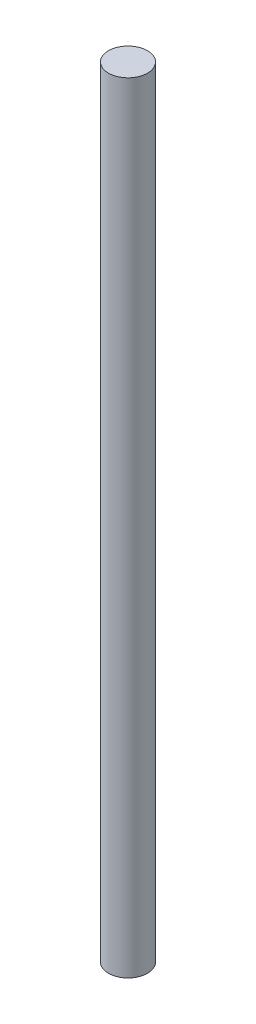
ISO-10303-21;
HEADER;
FILE_DESCRIPTION(('STEP AP214'),'2;1');
FILE_NAME('part.step','',(''),(''),'','','');
FILE_SCHEMA(('AUTOMOTIVE_DESIGN { 1 0 10303 214 1 1 1 1 }'));
ENDSEC;
DATA;
#1=APPLICATION_CONTEXT('core data for automotive mechanical design processes');
#2=APPLICATION_PROTOCOL_DEFINITION('international standard','automotive_design',2000,#1);
#3=PRODUCT_CONTEXT('',#1,'mechanical');
#4=PRODUCT('Part','Part','',(#3));
#5=PRODUCT_RELATED_PRODUCT_CATEGORY('part','',(#4));
#6=PRODUCT_DEFINITION_FORMATION('','',#4);
#7=PRODUCT_DEFINITION_CONTEXT('part definition',#1,'design');
#8=PRODUCT_DEFINITION('design','',#6,#7);
#9=PRODUCT_DEFINITION_SHAPE('','',#8);
#10=(LENGTH_UNIT() NAMED_UNIT(*) SI_UNIT(.MILLI.,.METRE.));
#11=(NAMED_UNIT(*) PLANE_ANGLE_UNIT() SI_UNIT($,.RADIAN.));
#12=(NAMED_UNIT(*) SI_UNIT($,.STERADIAN.) SOLID_ANGLE_UNIT());
#13=UNCERTAINTY_MEASURE_WITH_UNIT(LENGTH_MEASURE(1.E-05),#10,'distance_accuracy_value','');
#14=(GEOMETRIC_REPRESENTATION_CONTEXT(3) GLOBAL_UNCERTAINTY_ASSIGNED_CONTEXT((#13)) GLOBAL_UNIT_ASSIGNED_CONTEXT((#10,
#11,#12)) REPRESENTATION_CONTEXT('',''));
#15=CARTESIAN_POINT('',(0.,0.,0.));
#16=DIRECTION('',(0.,0.,1.));
#17=DIRECTION('',(1.,0.,0.));
#18=AXIS2_PLACEMENT_3D('',#15,#16,#17);
#19=CARTESIAN_POINT('',(0.,76.2,0.));
#20=DIRECTION('',(0.,-1.,0.));
#21=DIRECTION('',(0.,0.,-1.));
#22=AXIS2_PLACEMENT_3D('',#19,#20,#21);
#23=CYLINDRICAL_SURFACE('',#22,3.81);
#24=CARTESIAN_POINT('',(0.,76.2,0.));
#25=DIRECTION('',(0.,1.,0.));
#26=DIRECTION('',(0.,0.,1.));
#27=AXIS2_PLACEMENT_3D('',#24,#25,#26);
#28=CIRCLE('',#27,3.81);
#29=CARTESIAN_POINT('',(0.,76.2,3.81));
#30=VERTEX_POINT('',#29);
#31=EDGE_CURVE('E10',#30,#30,#28,.T.);
#32=ORIENTED_EDGE('',*,*,#31,.F.);
#33=EDGE_LOOP('',(#32));
#34=FACE_BOUND('',#33,.T.);
#35=CARTESIAN_POINT('',(0.,-76.2,0.));
#36=DIRECTION('',(0.,1.,0.));
#37=DIRECTION('',(0.,0.,1.));
#38=AXIS2_PLACEMENT_3D('',#35,#36,#37);
#39=CIRCLE('',#38,3.81);
#40=CARTESIAN_POINT('',(0.,-76.2,3.81));
#41=VERTEX_POINT('',#40);
#42=EDGE_CURVE('E46',#41,#41,#39,.T.);
#43=ORIENTED_EDGE('',*,*,#42,.T.);
#44=EDGE_LOOP('',(#43));
#45=FACE_BOUND('',#44,.T.);
#46=ADVANCED_FACE('F43',(#34,#45),#23,.T.);
#47=CARTESIAN_POINT('',(0.,76.2,0.));
#48=DIRECTION('',(0.,1.,0.));
#49=DIRECTION('',(0.,0.,1.));
#50=AXIS2_PLACEMENT_3D('',#47,#48,#49);
#51=PLANE('',#50);
#52=ORIENTED_EDGE('',*,*,#31,.T.);
#53=EDGE_LOOP('',(#52));
#54=FACE_BOUND('',#53,.T.);
#55=ADVANCED_FACE('F60',(#54),#51,.T.);
#56=CARTESIAN_POINT('',(0.,-76.2,0.));
#57=DIRECTION('',(0.,1.,0.));
#58=DIRECTION('',(0.,0.,1.));
#59=AXIS2_PLACEMENT_3D('',#56,#57,#58);
#60=PLANE('',#59);
#61=ORIENTED_EDGE('',*,*,#42,.F.);
#62=EDGE_LOOP('',(#61));
#63=FACE_BOUND('',#62,.T.);
#64=ADVANCED_FACE('F58',(#63),#60,.F.);
#65=CLOSED_SHELL('',(#46,#55,#64));
#66=MANIFOLD_SOLID_BREP('B2',#65);
#67=ADVANCED_BREP_SHAPE_REPRESENTATION('',(#18,#66),#14);
#68=SHAPE_DEFINITION_REPRESENTATION(#9,#67);
ENDSEC;
END-ISO-10303-21;
